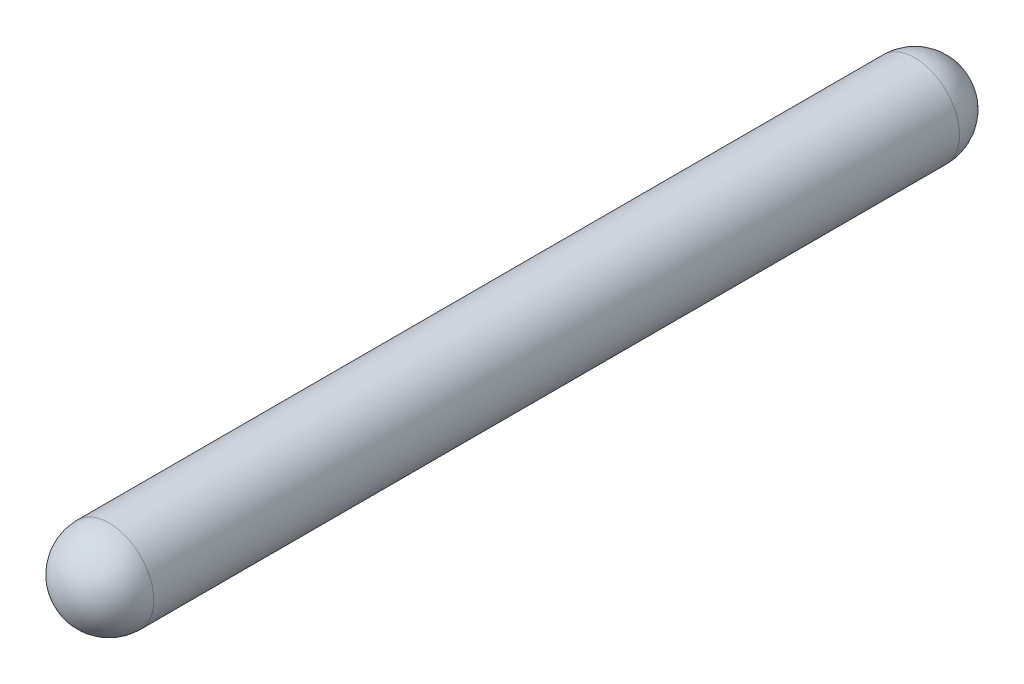
ISO-10303-21;
HEADER;
FILE_DESCRIPTION(('STEP AP214'),'2;1');
FILE_NAME('part.step','',(''),(''),'','','');
FILE_SCHEMA(('AUTOMOTIVE_DESIGN { 1 0 10303 214 1 1 1 1 }'));
ENDSEC;
DATA;
#1=APPLICATION_CONTEXT('core data for automotive mechanical design processes');
#2=APPLICATION_PROTOCOL_DEFINITION('international standard','automotive_design',2000,#1);
#3=PRODUCT_CONTEXT('',#1,'mechanical');
#4=PRODUCT('Part','Part','',(#3));
#5=PRODUCT_RELATED_PRODUCT_CATEGORY('part','',(#4));
#6=PRODUCT_DEFINITION_FORMATION('','',#4);
#7=PRODUCT_DEFINITION_CONTEXT('part definition',#1,'design');
#8=PRODUCT_DEFINITION('design','',#6,#7);
#9=PRODUCT_DEFINITION_SHAPE('','',#8);
#10=(LENGTH_UNIT() NAMED_UNIT(*) SI_UNIT(.MILLI.,.METRE.));
#11=(NAMED_UNIT(*) PLANE_ANGLE_UNIT() SI_UNIT($,.RADIAN.));
#12=(NAMED_UNIT(*) SI_UNIT($,.STERADIAN.) SOLID_ANGLE_UNIT());
#13=UNCERTAINTY_MEASURE_WITH_UNIT(LENGTH_MEASURE(1.E-05),#10,'distance_accuracy_value','');
#14=(GEOMETRIC_REPRESENTATION_CONTEXT(3) GLOBAL_UNCERTAINTY_ASSIGNED_CONTEXT((#13)) GLOBAL_UNIT_ASSIGNED_CONTEXT((#10,
#11,#12)) REPRESENTATION_CONTEXT('',''));
#15=CARTESIAN_POINT('',(0.,0.,0.));
#16=DIRECTION('',(0.,0.,1.));
#17=DIRECTION('',(1.,0.,0.));
#18=AXIS2_PLACEMENT_3D('',#15,#16,#17);
#19=CARTESIAN_POINT('',(0.,0.,45.));
#20=DIRECTION('',(0.,0.,-1.));
#21=DIRECTION('',(-1.,0.,0.));
#22=AXIS2_PLACEMENT_3D('',#19,#20,#21);
#23=CYLINDRICAL_SURFACE('',#22,3.);
#24=CARTESIAN_POINT('',(0.,0.,-12.));
#25=DIRECTION('',(0.,0.,-1.));
#26=DIRECTION('',(-1.,0.,0.));
#27=AXIS2_PLACEMENT_3D('',#24,#25,#26);
#28=CIRCLE('',#27,3.);
#29=CARTESIAN_POINT('',(-3.,0.,-12.));
#30=VERTEX_POINT('',#29);
#31=EDGE_CURVE('E10',#30,#30,#28,.F.);
#32=ORIENTED_EDGE('',*,*,#31,.T.);
#33=EDGE_LOOP('',(#32));
#34=FACE_BOUND('',#33,.T.);
#35=CARTESIAN_POINT('',(0.,0.,42.));
#36=DIRECTION('',(0.,0.,-1.));
#37=DIRECTION('',(-1.,0.,0.));
#38=AXIS2_PLACEMENT_3D('',#35,#36,#37);
#39=CIRCLE('',#38,3.);
#40=CARTESIAN_POINT('',(-3.,0.,42.));
#41=VERTEX_POINT('',#40);
#42=EDGE_CURVE('E54',#41,#41,#39,.T.);
#43=ORIENTED_EDGE('',*,*,#42,.T.);
#44=EDGE_LOOP('',(#43));
#45=FACE_BOUND('',#44,.T.);
#46=ADVANCED_FACE('F47',(#34,#45),#23,.T.);
#47=CARTESIAN_POINT('',(0.,0.,-12.));
#48=DIRECTION('',(0.,0.,1.));
#49=DIRECTION('',(1.,0.,0.));
#50=AXIS2_PLACEMENT_3D('',#47,#48,#49);
#51=SPHERICAL_SURFACE('',#50,3.);
#52=ORIENTED_EDGE('',*,*,#31,.F.);
#53=EDGE_LOOP('',(#52));
#54=FACE_BOUND('',#53,.T.);
#55=ADVANCED_FACE('F62',(#54),#51,.T.);
#56=CARTESIAN_POINT('',(0.,0.,42.));
#57=DIRECTION('',(0.,0.,1.));
#58=DIRECTION('',(1.,0.,0.));
#59=AXIS2_PLACEMENT_3D('',#56,#57,#58);
#60=SPHERICAL_SURFACE('',#59,3.);
#61=ORIENTED_EDGE('',*,*,#42,.F.);
#62=EDGE_LOOP('',(#61));
#63=FACE_BOUND('',#62,.T.);
#64=ADVANCED_FACE('F49',(#63),#60,.T.);
#65=CLOSED_SHELL('',(#46,#55,#64));
#66=MANIFOLD_SOLID_BREP('B2',#65);
#67=ADVANCED_BREP_SHAPE_REPRESENTATION('',(#18,#66),#14);
#68=SHAPE_DEFINITION_REPRESENTATION(#9,#67);
ENDSEC;
END-ISO-10303-21;
